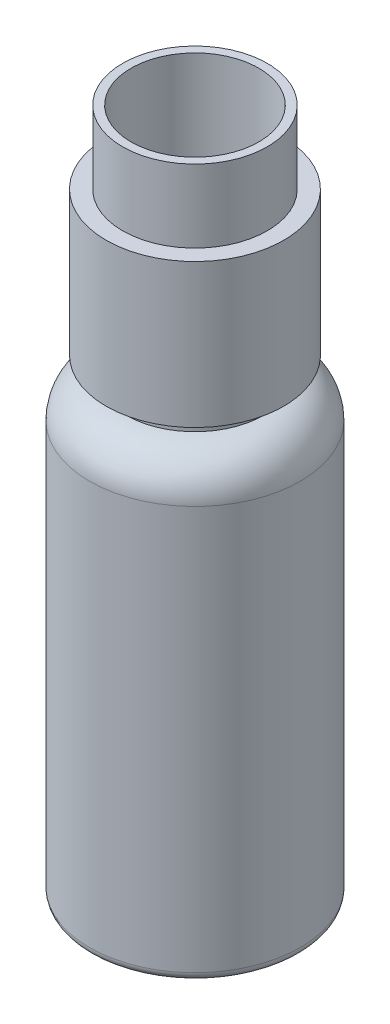
ISO-10303-21;
HEADER;
FILE_DESCRIPTION(('STEP AP214'),'2;1');
FILE_NAME('part.step','',(''),(''),'','','');
FILE_SCHEMA(('AUTOMOTIVE_DESIGN { 1 0 10303 214 1 1 1 1 }'));
ENDSEC;
DATA;
#1=APPLICATION_CONTEXT('core data for automotive mechanical design processes');
#2=APPLICATION_PROTOCOL_DEFINITION('international standard','automotive_design',2000,#1);
#3=PRODUCT_CONTEXT('',#1,'mechanical');
#4=PRODUCT('Part','Part','',(#3));
#5=PRODUCT_RELATED_PRODUCT_CATEGORY('part','',(#4));
#6=PRODUCT_DEFINITION_FORMATION('','',#4);
#7=PRODUCT_DEFINITION_CONTEXT('part definition',#1,'design');
#8=PRODUCT_DEFINITION('design','',#6,#7);
#9=PRODUCT_DEFINITION_SHAPE('','',#8);
#10=(LENGTH_UNIT() NAMED_UNIT(*) SI_UNIT(.MILLI.,.METRE.));
#11=(NAMED_UNIT(*) PLANE_ANGLE_UNIT() SI_UNIT($,.RADIAN.));
#12=(NAMED_UNIT(*) SI_UNIT($,.STERADIAN.) SOLID_ANGLE_UNIT());
#13=UNCERTAINTY_MEASURE_WITH_UNIT(LENGTH_MEASURE(1.E-05),#10,'distance_accuracy_value','');
#14=(GEOMETRIC_REPRESENTATION_CONTEXT(3) GLOBAL_UNCERTAINTY_ASSIGNED_CONTEXT((#13)) GLOBAL_UNIT_ASSIGNED_CONTEXT((#10,
#11,#12)) REPRESENTATION_CONTEXT('',''));
#15=CARTESIAN_POINT('',(0.,0.,0.));
#16=DIRECTION('',(0.,0.,1.));
#17=DIRECTION('',(1.,0.,0.));
#18=AXIS2_PLACEMENT_3D('',#15,#16,#17);
#19=CARTESIAN_POINT('',(0.,0.,0.));
#20=DIRECTION('',(0.,1.,0.));
#21=DIRECTION('',(0.,0.,1.));
#22=AXIS2_PLACEMENT_3D('',#19,#20,#21);
#23=PLANE('',#22);
#24=CARTESIAN_POINT('',(0.,0.,0.));
#25=DIRECTION('',(0.,1.,0.));
#26=DIRECTION('',(0.,0.,1.));
#27=AXIS2_PLACEMENT_3D('',#24,#25,#26);
#28=CIRCLE('',#27,10.875);
#29=CARTESIAN_POINT('',(0.,0.,10.875));
#30=VERTEX_POINT('',#29);
#31=EDGE_CURVE('E10',#30,#30,#28,.T.);
#32=ORIENTED_EDGE('',*,*,#31,.F.);
#33=EDGE_LOOP('',(#32));
#34=FACE_BOUND('',#33,.T.);
#35=CARTESIAN_POINT('',(0.,0.,0.));
#36=DIRECTION('',(0.,1.,0.));
#37=DIRECTION('',(0.,0.,1.));
#38=AXIS2_PLACEMENT_3D('',#35,#36,#37);
#39=CIRCLE('',#38,9.75);
#40=CARTESIAN_POINT('',(0.,0.,9.75));
#41=VERTEX_POINT('',#40);
#42=EDGE_CURVE('E91',#41,#41,#39,.T.);
#43=ORIENTED_EDGE('',*,*,#42,.T.);
#44=EDGE_LOOP('',(#43));
#45=FACE_BOUND('',#44,.T.);
#46=ADVANCED_FACE('F39',(#34,#45),#23,.F.);
#47=CARTESIAN_POINT('',(0.,1.,0.));
#48=DIRECTION('',(0.,1.,0.));
#49=DIRECTION('',(0.,0.,1.));
#50=AXIS2_PLACEMENT_3D('',#47,#48,#49);
#51=TOROIDAL_SURFACE('',#50,10.875,1.);
#52=CARTESIAN_POINT('',(0.,1.,0.));
#53=DIRECTION('',(0.,1.,0.));
#54=DIRECTION('',(0.,0.,1.));
#55=AXIS2_PLACEMENT_3D('',#52,#53,#54);
#56=CIRCLE('',#55,11.875);
#57=CARTESIAN_POINT('',(0.,1.,11.875));
#58=VERTEX_POINT('',#57);
#59=EDGE_CURVE('E45',#58,#58,#56,.T.);
#60=ORIENTED_EDGE('',*,*,#59,.F.);
#61=EDGE_LOOP('',(#60));
#62=FACE_BOUND('',#61,.T.);
#63=ORIENTED_EDGE('',*,*,#31,.T.);
#64=EDGE_LOOP('',(#63));
#65=FACE_BOUND('',#64,.T.);
#66=ADVANCED_FACE('F108',(#62,#65),#51,.T.);
#67=CARTESIAN_POINT('',(0.,65.8,0.));
#68=DIRECTION('',(0.,1.,0.));
#69=DIRECTION('',(0.,0.,1.));
#70=AXIS2_PLACEMENT_3D('',#67,#68,#69);
#71=CYLINDRICAL_SURFACE('',#70,11.875);
#72=CARTESIAN_POINT('',(0.,46.5,0.));
#73=DIRECTION('',(0.,1.,0.));
#74=DIRECTION('',(0.,0.,1.));
#75=AXIS2_PLACEMENT_3D('',#72,#73,#74);
#76=CIRCLE('',#75,11.875);
#77=CARTESIAN_POINT('',(0.,46.5,11.875));
#78=VERTEX_POINT('',#77);
#79=EDGE_CURVE('E49',#78,#78,#76,.T.);
#80=ORIENTED_EDGE('',*,*,#79,.F.);
#81=EDGE_LOOP('',(#80));
#82=FACE_BOUND('',#81,.T.);
#83=ORIENTED_EDGE('',*,*,#59,.T.);
#84=EDGE_LOOP('',(#83));
#85=FACE_BOUND('',#84,.T.);
#86=ADVANCED_FACE('F113',(#82,#85),#71,.T.);
#87=CARTESIAN_POINT('',(0.,46.5,0.));
#88=DIRECTION('',(0.,1.,0.));
#89=DIRECTION('',(0.,0.,1.));
#90=AXIS2_PLACEMENT_3D('',#87,#88,#89);
#91=TOROIDAL_SURFACE('',#90,7.5,4.375);
#92=CARTESIAN_POINT('',(0.,50.875,0.));
#93=DIRECTION('',(0.,1.,0.));
#94=DIRECTION('',(0.,0.,1.));
#95=AXIS2_PLACEMENT_3D('',#92,#93,#94);
#96=CIRCLE('',#95,7.5);
#97=CARTESIAN_POINT('',(0.,50.875,7.5));
#98=VERTEX_POINT('',#97);
#99=EDGE_CURVE('E53',#98,#98,#96,.T.);
#100=ORIENTED_EDGE('',*,*,#99,.F.);
#101=EDGE_LOOP('',(#100));
#102=FACE_BOUND('',#101,.T.);
#103=ORIENTED_EDGE('',*,*,#79,.T.);
#104=EDGE_LOOP('',(#103));
#105=FACE_BOUND('',#104,.T.);
#106=ADVANCED_FACE('F118',(#102,#105),#91,.T.);
#107=CARTESIAN_POINT('',(0.,50.875,0.));
#108=DIRECTION('',(0.,1.,0.));
#109=DIRECTION('',(0.,0.,1.));
#110=AXIS2_PLACEMENT_3D('',#107,#108,#109);
#111=PLANE('',#110);
#112=CARTESIAN_POINT('',(0.,50.875,0.));
#113=DIRECTION('',(0.,1.,0.));
#114=DIRECTION('',(0.,0.,1.));
#115=AXIS2_PLACEMENT_3D('',#112,#113,#114);
#116=CIRCLE('',#115,7.75);
#117=CARTESIAN_POINT('',(0.,50.875,7.75));
#118=VERTEX_POINT('',#117);
#119=EDGE_CURVE('E58',#118,#118,#116,.T.);
#120=ORIENTED_EDGE('',*,*,#119,.F.);
#121=EDGE_LOOP('',(#120));
#122=FACE_BOUND('',#121,.T.);
#123=ORIENTED_EDGE('',*,*,#99,.T.);
#124=EDGE_LOOP('',(#123));
#125=FACE_BOUND('',#124,.T.);
#126=ADVANCED_FACE('F124',(#122,#125),#111,.F.);
#127=CARTESIAN_POINT('',(0.,65.8,0.));
#128=DIRECTION('',(0.,1.,0.));
#129=DIRECTION('',(0.,0.,1.));
#130=AXIS2_PLACEMENT_3D('',#127,#128,#129);
#131=CYLINDRICAL_SURFACE('',#130,7.75);
#132=CARTESIAN_POINT('',(0.,52.875,0.));
#133=DIRECTION('',(0.,1.,0.));
#134=DIRECTION('',(0.,0.,1.));
#135=AXIS2_PLACEMENT_3D('',#132,#133,#134);
#136=CIRCLE('',#135,7.75);
#137=CARTESIAN_POINT('',(0.,52.875,7.75));
#138=VERTEX_POINT('',#137);
#139=EDGE_CURVE('E61',#138,#138,#136,.T.);
#140=ORIENTED_EDGE('',*,*,#139,.F.);
#141=EDGE_LOOP('',(#140));
#142=FACE_BOUND('',#141,.T.);
#143=ORIENTED_EDGE('',*,*,#119,.T.);
#144=EDGE_LOOP('',(#143));
#145=FACE_BOUND('',#144,.T.);
#146=ADVANCED_FACE('F128',(#142,#145),#131,.T.);
#147=CARTESIAN_POINT('',(0.,52.875,0.));
#148=DIRECTION('',(0.,1.,0.));
#149=DIRECTION('',(0.,0.,1.));
#150=AXIS2_PLACEMENT_3D('',#147,#148,#149);
#151=PLANE('',#150);
#152=CARTESIAN_POINT('',(0.,52.875,0.));
#153=DIRECTION('',(0.,1.,0.));
#154=DIRECTION('',(0.,0.,1.));
#155=AXIS2_PLACEMENT_3D('',#152,#153,#154);
#156=CIRCLE('',#155,10.);
#157=CARTESIAN_POINT('',(0.,52.875,10.));
#158=VERTEX_POINT('',#157);
#159=EDGE_CURVE('E64',#158,#158,#156,.T.);
#160=ORIENTED_EDGE('',*,*,#159,.F.);
#161=EDGE_LOOP('',(#160));
#162=FACE_BOUND('',#161,.T.);
#163=ORIENTED_EDGE('',*,*,#139,.T.);
#164=EDGE_LOOP('',(#163));
#165=FACE_BOUND('',#164,.T.);
#166=ADVANCED_FACE('F132',(#162,#165),#151,.F.);
#167=CARTESIAN_POINT('',(0.,65.8,0.));
#168=DIRECTION('',(0.,1.,0.));
#169=DIRECTION('',(0.,0.,1.));
#170=AXIS2_PLACEMENT_3D('',#167,#168,#169);
#171=CYLINDRICAL_SURFACE('',#170,10.);
#172=CARTESIAN_POINT('',(0.,69.075,0.));
#173=DIRECTION('',(0.,1.,0.));
#174=DIRECTION('',(0.,0.,1.));
#175=AXIS2_PLACEMENT_3D('',#172,#173,#174);
#176=CIRCLE('',#175,10.);
#177=CARTESIAN_POINT('',(0.,69.075,10.));
#178=VERTEX_POINT('',#177);
#179=EDGE_CURVE('E67',#178,#178,#176,.T.);
#180=ORIENTED_EDGE('',*,*,#179,.F.);
#181=EDGE_LOOP('',(#180));
#182=FACE_BOUND('',#181,.T.);
#183=ORIENTED_EDGE('',*,*,#159,.T.);
#184=EDGE_LOOP('',(#183));
#185=FACE_BOUND('',#184,.T.);
#186=ADVANCED_FACE('F136',(#182,#185),#171,.T.);
#187=CARTESIAN_POINT('',(0.,69.075,0.));
#188=DIRECTION('',(0.,-1.,0.));
#189=DIRECTION('',(0.,0.,-1.));
#190=AXIS2_PLACEMENT_3D('',#187,#188,#189);
#191=PLANE('',#190);
#192=CARTESIAN_POINT('',(0.,69.075,0.));
#193=DIRECTION('',(0.,1.,0.));
#194=DIRECTION('',(0.,0.,1.));
#195=AXIS2_PLACEMENT_3D('',#192,#193,#194);
#196=CIRCLE('',#195,8.15);
#197=CARTESIAN_POINT('',(0.,69.075,8.15));
#198=VERTEX_POINT('',#197);
#199=EDGE_CURVE('E70',#198,#198,#196,.T.);
#200=ORIENTED_EDGE('',*,*,#199,.F.);
#201=EDGE_LOOP('',(#200));
#202=FACE_BOUND('',#201,.T.);
#203=ORIENTED_EDGE('',*,*,#179,.T.);
#204=EDGE_LOOP('',(#203));
#205=FACE_BOUND('',#204,.T.);
#206=ADVANCED_FACE('F140',(#202,#205),#191,.F.);
#207=CARTESIAN_POINT('',(0.,65.8,0.));
#208=DIRECTION('',(0.,1.,0.));
#209=DIRECTION('',(0.,0.,1.));
#210=AXIS2_PLACEMENT_3D('',#207,#208,#209);
#211=CYLINDRICAL_SURFACE('',#210,8.15);
#212=CARTESIAN_POINT('',(0.,77.275,0.));
#213=DIRECTION('',(0.,1.,0.));
#214=DIRECTION('',(0.,0.,1.));
#215=AXIS2_PLACEMENT_3D('',#212,#213,#214);
#216=CIRCLE('',#215,8.15);
#217=CARTESIAN_POINT('',(0.,77.275,8.15));
#218=VERTEX_POINT('',#217);
#219=EDGE_CURVE('E73',#218,#218,#216,.T.);
#220=ORIENTED_EDGE('',*,*,#219,.F.);
#221=EDGE_LOOP('',(#220));
#222=FACE_BOUND('',#221,.T.);
#223=ORIENTED_EDGE('',*,*,#199,.T.);
#224=EDGE_LOOP('',(#223));
#225=FACE_BOUND('',#224,.T.);
#226=ADVANCED_FACE('F144',(#222,#225),#211,.T.);
#227=CARTESIAN_POINT('',(0.,77.275,0.));
#228=DIRECTION('',(0.,-1.,0.));
#229=DIRECTION('',(0.,0.,-1.));
#230=AXIS2_PLACEMENT_3D('',#227,#228,#229);
#231=PLANE('',#230);
#232=CARTESIAN_POINT('',(0.,77.275,0.));
#233=DIRECTION('',(0.,1.,0.));
#234=DIRECTION('',(0.,0.,1.));
#235=AXIS2_PLACEMENT_3D('',#232,#233,#234);
#236=CIRCLE('',#235,7.2);
#237=CARTESIAN_POINT('',(0.,77.275,7.2));
#238=VERTEX_POINT('',#237);
#239=EDGE_CURVE('E76',#238,#238,#236,.T.);
#240=ORIENTED_EDGE('',*,*,#239,.F.);
#241=EDGE_LOOP('',(#240));
#242=FACE_BOUND('',#241,.T.);
#243=ORIENTED_EDGE('',*,*,#219,.T.);
#244=EDGE_LOOP('',(#243));
#245=FACE_BOUND('',#244,.T.);
#246=ADVANCED_FACE('F148',(#242,#245),#231,.F.);
#247=CARTESIAN_POINT('',(0.,65.8,0.));
#248=DIRECTION('',(0.,1.,0.));
#249=DIRECTION('',(0.,0.,1.));
#250=AXIS2_PLACEMENT_3D('',#247,#248,#249);
#251=CYLINDRICAL_SURFACE('',#250,7.2);
#252=CARTESIAN_POINT('',(0.,63.575,0.));
#253=DIRECTION('',(0.,1.,0.));
#254=DIRECTION('',(0.,0.,1.));
#255=AXIS2_PLACEMENT_3D('',#252,#253,#254);
#256=CIRCLE('',#255,7.2);
#257=CARTESIAN_POINT('',(0.,63.575,7.2));
#258=VERTEX_POINT('',#257);
#259=EDGE_CURVE('E79',#258,#258,#256,.T.);
#260=ORIENTED_EDGE('',*,*,#259,.F.);
#261=EDGE_LOOP('',(#260));
#262=FACE_BOUND('',#261,.T.);
#263=ORIENTED_EDGE('',*,*,#239,.T.);
#264=EDGE_LOOP('',(#263));
#265=FACE_BOUND('',#264,.T.);
#266=ADVANCED_FACE('F152',(#262,#265),#251,.F.);
#267=CARTESIAN_POINT('',(0.,63.575,0.));
#268=DIRECTION('',(0.,1.,0.));
#269=DIRECTION('',(0.,0.,1.));
#270=AXIS2_PLACEMENT_3D('',#267,#268,#269);
#271=PLANE('',#270);
#272=ORIENTED_EDGE('',*,*,#259,.T.);
#273=EDGE_LOOP('',(#272));
#274=FACE_BOUND('',#273,.T.);
#275=ADVANCED_FACE('F156',(#274),#271,.T.);
#276=CARTESIAN_POINT('',(0.,2.40955855165527,0.));
#277=DIRECTION('',(0.,-1.,0.));
#278=DIRECTION('',(0.,0.,-1.));
#279=AXIS2_PLACEMENT_3D('',#276,#277,#278);
#280=PLANE('',#279);
#281=CARTESIAN_POINT('',(0.,2.40955855165527,0.));
#282=DIRECTION('',(0.,1.,0.));
#283=DIRECTION('',(0.,0.,1.));
#284=AXIS2_PLACEMENT_3D('',#281,#282,#283);
#285=CIRCLE('',#284,7.75);
#286=CARTESIAN_POINT('',(0.,2.40955855165527,7.75));
#287=VERTEX_POINT('',#286);
#288=EDGE_CURVE('E82',#287,#287,#285,.T.);
#289=ORIENTED_EDGE('',*,*,#288,.F.);
#290=EDGE_LOOP('',(#289));
#291=FACE_BOUND('',#290,.T.);
#292=ADVANCED_FACE('F160',(#291),#280,.T.);
#293=CARTESIAN_POINT('',(0.,1.40955855165527,0.));
#294=DIRECTION('',(0.,1.,0.));
#295=DIRECTION('',(0.,0.,1.));
#296=AXIS2_PLACEMENT_3D('',#293,#294,#295);
#297=TOROIDAL_SURFACE('',#296,7.75,1.);
#298=ORIENTED_EDGE('',*,*,#288,.T.);
#299=EDGE_LOOP('',(#298));
#300=FACE_BOUND('',#299,.T.);
#301=CARTESIAN_POINT('',(0.,1.40955855165527,0.));
#302=DIRECTION('',(0.,1.,0.));
#303=DIRECTION('',(0.,0.,1.));
#304=AXIS2_PLACEMENT_3D('',#301,#302,#303);
#305=CIRCLE('',#304,8.75);
#306=CARTESIAN_POINT('',(0.,1.40955855165527,8.75));
#307=VERTEX_POINT('',#306);
#308=EDGE_CURVE('E85',#307,#307,#305,.T.);
#309=ORIENTED_EDGE('',*,*,#308,.F.);
#310=EDGE_LOOP('',(#309));
#311=FACE_BOUND('',#310,.T.);
#312=ADVANCED_FACE('F104',(#300,#311),#297,.F.);
#313=CARTESIAN_POINT('',(0.,65.8,0.));
#314=DIRECTION('',(0.,1.,0.));
#315=DIRECTION('',(0.,0.,1.));
#316=AXIS2_PLACEMENT_3D('',#313,#314,#315);
#317=CYLINDRICAL_SURFACE('',#316,8.75);
#318=ORIENTED_EDGE('',*,*,#308,.T.);
#319=EDGE_LOOP('',(#318));
#320=FACE_BOUND('',#319,.T.);
#321=CARTESIAN_POINT('',(0.,1.,0.));
#322=DIRECTION('',(0.,1.,0.));
#323=DIRECTION('',(0.,0.,1.));
#324=AXIS2_PLACEMENT_3D('',#321,#322,#323);
#325=CIRCLE('',#324,8.75);
#326=CARTESIAN_POINT('',(0.,1.,8.75));
#327=VERTEX_POINT('',#326);
#328=EDGE_CURVE('E88',#327,#327,#325,.T.);
#329=ORIENTED_EDGE('',*,*,#328,.F.);
#330=EDGE_LOOP('',(#329));
#331=FACE_BOUND('',#330,.T.);
#332=ADVANCED_FACE('F98',(#320,#331),#317,.F.);
#333=CARTESIAN_POINT('',(0.,1.,0.));
#334=DIRECTION('',(0.,1.,0.));
#335=DIRECTION('',(0.,0.,1.));
#336=AXIS2_PLACEMENT_3D('',#333,#334,#335);
#337=TOROIDAL_SURFACE('',#336,9.75,1.);
#338=ORIENTED_EDGE('',*,*,#328,.T.);
#339=EDGE_LOOP('',(#338));
#340=FACE_BOUND('',#339,.T.);
#341=ORIENTED_EDGE('',*,*,#42,.F.);
#342=EDGE_LOOP('',(#341));
#343=FACE_BOUND('',#342,.T.);
#344=ADVANCED_FACE('F96',(#340,#343),#337,.T.);
#345=CLOSED_SHELL('',(#46,#66,#86,#106,#126,#146,#166,#186,#206,#226,#246,#266,#275,#292,#312,
#332,#344));
#346=MANIFOLD_SOLID_BREP('B2',#345);
#347=ADVANCED_BREP_SHAPE_REPRESENTATION('',(#18,#346),#14);
#348=SHAPE_DEFINITION_REPRESENTATION(#9,#347);
ENDSEC;
END-ISO-10303-21;
